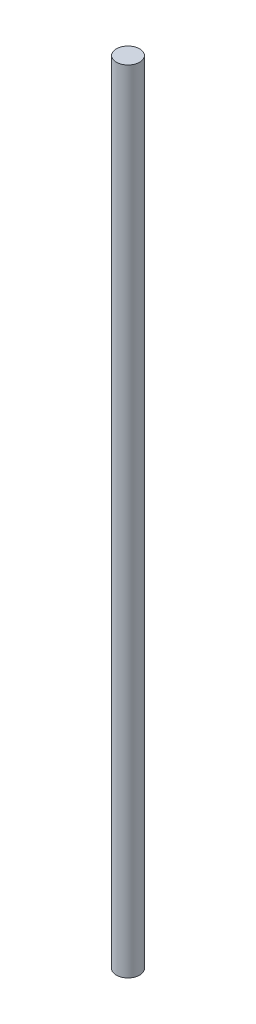
ISO-10303-21;
HEADER;
FILE_DESCRIPTION(('STEP AP214'),'2;1');
FILE_NAME('part.step','',(''),(''),'','','');
FILE_SCHEMA(('AUTOMOTIVE_DESIGN { 1 0 10303 214 1 1 1 1 }'));
ENDSEC;
DATA;
#1=APPLICATION_CONTEXT('core data for automotive mechanical design processes');
#2=APPLICATION_PROTOCOL_DEFINITION('international standard','automotive_design',2000,#1);
#3=PRODUCT_CONTEXT('',#1,'mechanical');
#4=PRODUCT('Part','Part','',(#3));
#5=PRODUCT_RELATED_PRODUCT_CATEGORY('part','',(#4));
#6=PRODUCT_DEFINITION_FORMATION('','',#4);
#7=PRODUCT_DEFINITION_CONTEXT('part definition',#1,'design');
#8=PRODUCT_DEFINITION('design','',#6,#7);
#9=PRODUCT_DEFINITION_SHAPE('','',#8);
#10=(LENGTH_UNIT() NAMED_UNIT(*) SI_UNIT(.MILLI.,.METRE.));
#11=(NAMED_UNIT(*) PLANE_ANGLE_UNIT() SI_UNIT($,.RADIAN.));
#12=(NAMED_UNIT(*) SI_UNIT($,.STERADIAN.) SOLID_ANGLE_UNIT());
#13=UNCERTAINTY_MEASURE_WITH_UNIT(LENGTH_MEASURE(1.E-05),#10,'distance_accuracy_value','');
#14=(GEOMETRIC_REPRESENTATION_CONTEXT(3) GLOBAL_UNCERTAINTY_ASSIGNED_CONTEXT((#13)) GLOBAL_UNIT_ASSIGNED_CONTEXT((#10,
#11,#12)) REPRESENTATION_CONTEXT('',''));
#15=CARTESIAN_POINT('',(0.,0.,0.));
#16=DIRECTION('',(0.,0.,1.));
#17=DIRECTION('',(1.,0.,0.));
#18=AXIS2_PLACEMENT_3D('',#15,#16,#17);
#19=CARTESIAN_POINT('',(0.,340.,0.));
#20=DIRECTION('',(0.,-1.,0.));
#21=DIRECTION('',(0.,0.,-1.));
#22=AXIS2_PLACEMENT_3D('',#19,#20,#21);
#23=CYLINDRICAL_SURFACE('',#22,5.);
#24=CARTESIAN_POINT('',(0.,340.,0.));
#25=DIRECTION('',(0.,1.,0.));
#26=DIRECTION('',(0.,0.,1.));
#27=AXIS2_PLACEMENT_3D('',#24,#25,#26);
#28=CIRCLE('',#27,5.);
#29=CARTESIAN_POINT('',(0.,340.,5.));
#30=VERTEX_POINT('',#29);
#31=EDGE_CURVE('E10',#30,#30,#28,.T.);
#32=ORIENTED_EDGE('',*,*,#31,.F.);
#33=EDGE_LOOP('',(#32));
#34=FACE_BOUND('',#33,.T.);
#35=CARTESIAN_POINT('',(0.,0.,0.));
#36=DIRECTION('',(0.,1.,0.));
#37=DIRECTION('',(0.,0.,1.));
#38=AXIS2_PLACEMENT_3D('',#35,#36,#37);
#39=CIRCLE('',#38,5.);
#40=CARTESIAN_POINT('',(0.,0.,5.));
#41=VERTEX_POINT('',#40);
#42=EDGE_CURVE('E40',#41,#41,#39,.T.);
#43=ORIENTED_EDGE('',*,*,#42,.T.);
#44=EDGE_LOOP('',(#43));
#45=FACE_BOUND('',#44,.T.);
#46=ADVANCED_FACE('F37',(#34,#45),#23,.T.);
#47=CARTESIAN_POINT('',(0.,340.,0.));
#48=DIRECTION('',(0.,1.,0.));
#49=DIRECTION('',(0.,0.,1.));
#50=AXIS2_PLACEMENT_3D('',#47,#48,#49);
#51=PLANE('',#50);
#52=ORIENTED_EDGE('',*,*,#31,.T.);
#53=EDGE_LOOP('',(#52));
#54=FACE_BOUND('',#53,.T.);
#55=ADVANCED_FACE('F54',(#54),#51,.T.);
#56=CARTESIAN_POINT('',(0.,0.,0.));
#57=DIRECTION('',(0.,1.,0.));
#58=DIRECTION('',(0.,0.,1.));
#59=AXIS2_PLACEMENT_3D('',#56,#57,#58);
#60=PLANE('',#59);
#61=ORIENTED_EDGE('',*,*,#42,.F.);
#62=EDGE_LOOP('',(#61));
#63=FACE_BOUND('',#62,.T.);
#64=ADVANCED_FACE('F52',(#63),#60,.F.);
#65=CLOSED_SHELL('',(#46,#55,#64));
#66=MANIFOLD_SOLID_BREP('B2',#65);
#67=ADVANCED_BREP_SHAPE_REPRESENTATION('',(#18,#66),#14);
#68=SHAPE_DEFINITION_REPRESENTATION(#9,#67);
ENDSEC;
END-ISO-10303-21;
